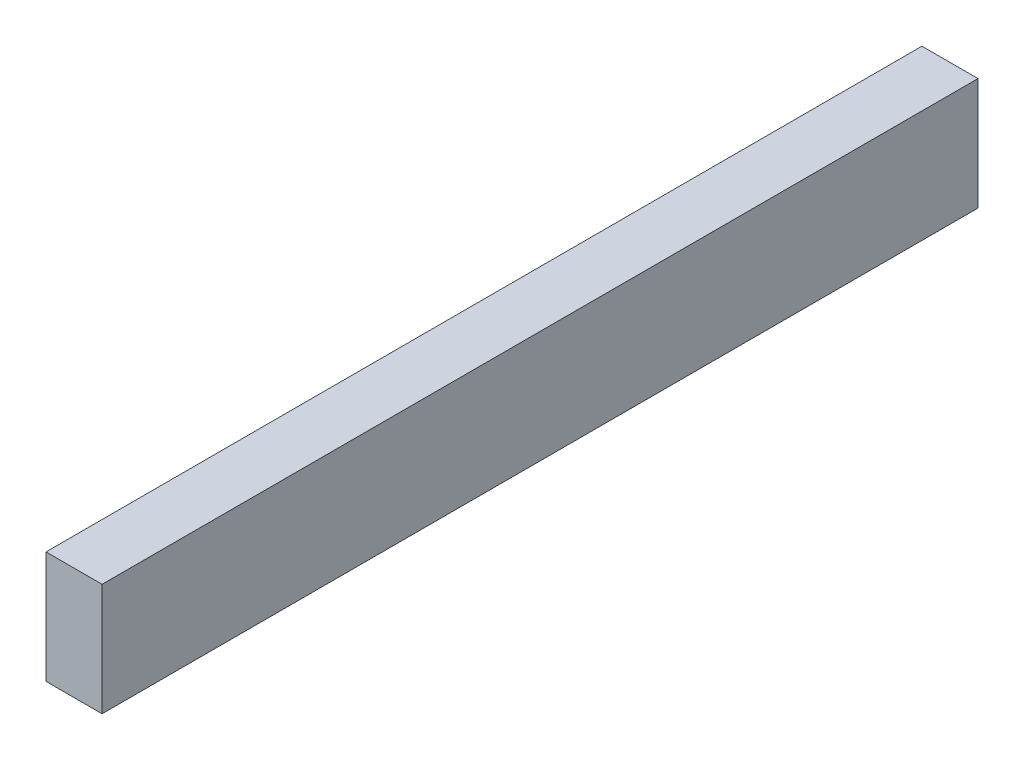
ISO-10303-21;
HEADER;
FILE_DESCRIPTION(('STEP AP214'),'2;1');
FILE_NAME('part.step','',(''),(''),'','','');
FILE_SCHEMA(('AUTOMOTIVE_DESIGN { 1 0 10303 214 1 1 1 1 }'));
ENDSEC;
DATA;
#1=APPLICATION_CONTEXT('core data for automotive mechanical design processes');
#2=APPLICATION_PROTOCOL_DEFINITION('international standard','automotive_design',2000,#1);
#3=PRODUCT_CONTEXT('',#1,'mechanical');
#4=PRODUCT('Part','Part','',(#3));
#5=PRODUCT_RELATED_PRODUCT_CATEGORY('part','',(#4));
#6=PRODUCT_DEFINITION_FORMATION('','',#4);
#7=PRODUCT_DEFINITION_CONTEXT('part definition',#1,'design');
#8=PRODUCT_DEFINITION('design','',#6,#7);
#9=PRODUCT_DEFINITION_SHAPE('','',#8);
#10=(LENGTH_UNIT() NAMED_UNIT(*) SI_UNIT(.MILLI.,.METRE.));
#11=(NAMED_UNIT(*) PLANE_ANGLE_UNIT() SI_UNIT($,.RADIAN.));
#12=(NAMED_UNIT(*) SI_UNIT($,.STERADIAN.) SOLID_ANGLE_UNIT());
#13=UNCERTAINTY_MEASURE_WITH_UNIT(LENGTH_MEASURE(1.E-05),#10,'distance_accuracy_value','');
#14=(GEOMETRIC_REPRESENTATION_CONTEXT(3) GLOBAL_UNCERTAINTY_ASSIGNED_CONTEXT((#13)) GLOBAL_UNIT_ASSIGNED_CONTEXT((#10,
#11,#12)) REPRESENTATION_CONTEXT('',''));
#15=CARTESIAN_POINT('',(0.,0.,0.));
#16=DIRECTION('',(0.,0.,1.));
#17=DIRECTION('',(1.,0.,0.));
#18=AXIS2_PLACEMENT_3D('',#15,#16,#17);
#19=CARTESIAN_POINT('',(19.05,-37.5210823008849,119.145892920354));
#20=DIRECTION('',(0.,0.,-1.));
#21=DIRECTION('',(-1.,0.,0.));
#22=AXIS2_PLACEMENT_3D('',#19,#20,#21);
#23=PLANE('',#22);
#24=DIRECTION('',(0.,-1.,0.));
#25=VECTOR('',#24,1.);
#26=CARTESIAN_POINT('',(0.,-37.5210823008849,119.145892920354));
#27=LINE('',#26,#25);
#28=CARTESIAN_POINT('',(0.,0.578917699115084,119.145892920354));
#29=VERTEX_POINT('',#28);
#30=CARTESIAN_POINT('',(0.,-37.5210823008849,119.145892920354));
#31=VERTEX_POINT('',#30);
#32=EDGE_CURVE('E107',#29,#31,#27,.T.);
#33=ORIENTED_EDGE('',*,*,#32,.T.);
#34=DIRECTION('',(-1.,0.,0.));
#35=VECTOR('',#34,1.);
#36=CARTESIAN_POINT('',(19.05,-37.5210823008849,119.145892920354));
#37=LINE('',#36,#35);
#38=CARTESIAN_POINT('',(19.05,-37.5210823008849,119.145892920354));
#39=VERTEX_POINT('',#38);
#40=EDGE_CURVE('E11',#39,#31,#37,.T.);
#41=ORIENTED_EDGE('',*,*,#40,.F.);
#42=DIRECTION('',(0.,-1.,0.));
#43=VECTOR('',#42,1.);
#44=CARTESIAN_POINT('',(19.05,-37.5210823008849,119.145892920354));
#45=LINE('',#44,#43);
#46=CARTESIAN_POINT('',(19.05,0.578917699115084,119.145892920354));
#47=VERTEX_POINT('',#46);
#48=EDGE_CURVE('E91',#47,#39,#45,.T.);
#49=ORIENTED_EDGE('',*,*,#48,.F.);
#50=DIRECTION('',(-1.,0.,0.));
#51=VECTOR('',#50,1.);
#52=CARTESIAN_POINT('',(19.05,0.578917699115084,119.145892920354));
#53=LINE('',#52,#51);
#54=EDGE_CURVE('E103',#47,#29,#53,.T.);
#55=ORIENTED_EDGE('',*,*,#54,.T.);
#56=EDGE_LOOP('',(#33,#41,#49,#55));
#57=FACE_BOUND('',#56,.T.);
#58=ADVANCED_FACE('F39',(#57),#23,.F.);
#59=CARTESIAN_POINT('',(19.05,-37.5210823008849,119.145892920354));
#60=DIRECTION('',(0.,1.,0.));
#61=DIRECTION('',(0.,0.,1.));
#62=AXIS2_PLACEMENT_3D('',#59,#60,#61);
#63=PLANE('',#62);
#64=DIRECTION('',(0.,0.,-1.));
#65=VECTOR('',#64,1.);
#66=CARTESIAN_POINT('',(0.,-37.5210823008849,119.145892920354));
#67=LINE('',#66,#65);
#68=CARTESIAN_POINT('',(0.,-37.5210823008849,-178.389707079646));
#69=VERTEX_POINT('',#68);
#70=EDGE_CURVE('E96',#31,#69,#67,.T.);
#71=ORIENTED_EDGE('',*,*,#70,.T.);
#72=DIRECTION('',(-1.,0.,0.));
#73=VECTOR('',#72,1.);
#74=CARTESIAN_POINT('',(19.05,-37.5210823008849,-178.389707079646));
#75=LINE('',#74,#73);
#76=CARTESIAN_POINT('',(19.05,-37.5210823008849,-178.389707079646));
#77=VERTEX_POINT('',#76);
#78=EDGE_CURVE('E48',#77,#69,#75,.T.);
#79=ORIENTED_EDGE('',*,*,#78,.F.);
#80=DIRECTION('',(0.,0.,-1.));
#81=VECTOR('',#80,1.);
#82=CARTESIAN_POINT('',(19.05,-37.5210823008849,119.145892920354));
#83=LINE('',#82,#81);
#84=EDGE_CURVE('E86',#39,#77,#83,.T.);
#85=ORIENTED_EDGE('',*,*,#84,.F.);
#86=ORIENTED_EDGE('',*,*,#40,.T.);
#87=EDGE_LOOP('',(#71,#79,#85,#86));
#88=FACE_BOUND('',#87,.T.);
#89=ADVANCED_FACE('F95',(#88),#63,.F.);
#90=CARTESIAN_POINT('',(19.05,-37.5210823008849,-178.389707079646));
#91=DIRECTION('',(0.,0.,1.));
#92=DIRECTION('',(0.,-1.,0.));
#93=AXIS2_PLACEMENT_3D('',#90,#91,#92);
#94=PLANE('',#93);
#95=DIRECTION('',(0.,1.,0.));
#96=VECTOR('',#95,1.);
#97=CARTESIAN_POINT('',(0.,-37.5210823008849,-178.389707079646));
#98=LINE('',#97,#96);
#99=CARTESIAN_POINT('',(0.,0.578917699115084,-178.389707079646));
#100=VERTEX_POINT('',#99);
#101=EDGE_CURVE('E73',#69,#100,#98,.T.);
#102=ORIENTED_EDGE('',*,*,#101,.T.);
#103=DIRECTION('',(-1.,0.,0.));
#104=VECTOR('',#103,1.);
#105=CARTESIAN_POINT('',(19.05,0.578917699115084,-178.389707079646));
#106=LINE('',#105,#104);
#107=CARTESIAN_POINT('',(19.05,0.578917699115084,-178.389707079646));
#108=VERTEX_POINT('',#107);
#109=EDGE_CURVE('E98',#108,#100,#106,.T.);
#110=ORIENTED_EDGE('',*,*,#109,.F.);
#111=DIRECTION('',(0.,1.,0.));
#112=VECTOR('',#111,1.);
#113=CARTESIAN_POINT('',(19.05,-37.5210823008849,-178.389707079646));
#114=LINE('',#113,#112);
#115=EDGE_CURVE('E89',#77,#108,#114,.T.);
#116=ORIENTED_EDGE('',*,*,#115,.F.);
#117=ORIENTED_EDGE('',*,*,#78,.T.);
#118=EDGE_LOOP('',(#102,#110,#116,#117));
#119=FACE_BOUND('',#118,.T.);
#120=ADVANCED_FACE('F99',(#119),#94,.F.);
#121=CARTESIAN_POINT('',(19.05,0.578917699115084,119.145892920354));
#122=DIRECTION('',(0.,-1.,0.));
#123=DIRECTION('',(0.,0.,-1.));
#124=AXIS2_PLACEMENT_3D('',#121,#122,#123);
#125=PLANE('',#124);
#126=DIRECTION('',(0.,0.,1.));
#127=VECTOR('',#126,1.);
#128=CARTESIAN_POINT('',(0.,0.578917699115084,119.145892920354));
#129=LINE('',#128,#127);
#130=EDGE_CURVE('E79',#100,#29,#129,.T.);
#131=ORIENTED_EDGE('',*,*,#130,.T.);
#132=ORIENTED_EDGE('',*,*,#54,.F.);
#133=DIRECTION('',(0.,0.,1.));
#134=VECTOR('',#133,1.);
#135=CARTESIAN_POINT('',(19.05,0.578917699115084,119.145892920354));
#136=LINE('',#135,#134);
#137=EDGE_CURVE('E56',#108,#47,#136,.T.);
#138=ORIENTED_EDGE('',*,*,#137,.F.);
#139=ORIENTED_EDGE('',*,*,#109,.T.);
#140=EDGE_LOOP('',(#131,#132,#138,#139));
#141=FACE_BOUND('',#140,.T.);
#142=ADVANCED_FACE('F120',(#141),#125,.F.);
#143=CARTESIAN_POINT('',(19.05,0.,0.));
#144=DIRECTION('',(-1.,0.,0.));
#145=DIRECTION('',(0.,0.,1.));
#146=AXIS2_PLACEMENT_3D('',#143,#144,#145);
#147=PLANE('',#146);
#148=ORIENTED_EDGE('',*,*,#48,.T.);
#149=ORIENTED_EDGE('',*,*,#84,.T.);
#150=ORIENTED_EDGE('',*,*,#115,.T.);
#151=ORIENTED_EDGE('',*,*,#137,.T.);
#152=EDGE_LOOP('',(#148,#149,#150,#151));
#153=FACE_BOUND('',#152,.T.);
#154=ADVANCED_FACE('F87',(#153),#147,.F.);
#155=CARTESIAN_POINT('',(0.,0.,0.));
#156=DIRECTION('',(-1.,0.,0.));
#157=DIRECTION('',(0.,0.,1.));
#158=AXIS2_PLACEMENT_3D('',#155,#156,#157);
#159=PLANE('',#158);
#160=ORIENTED_EDGE('',*,*,#32,.F.);
#161=ORIENTED_EDGE('',*,*,#130,.F.);
#162=ORIENTED_EDGE('',*,*,#101,.F.);
#163=ORIENTED_EDGE('',*,*,#70,.F.);
#164=EDGE_LOOP('',(#160,#161,#162,#163));
#165=FACE_BOUND('',#164,.T.);
#166=ADVANCED_FACE('F123',(#165),#159,.T.);
#167=CLOSED_SHELL('',(#58,#89,#120,#142,#154,#166));
#168=MANIFOLD_SOLID_BREP('B2',#167);
#169=ADVANCED_BREP_SHAPE_REPRESENTATION('',(#18,#168),#14);
#170=SHAPE_DEFINITION_REPRESENTATION(#9,#169);
ENDSEC;
END-ISO-10303-21;
